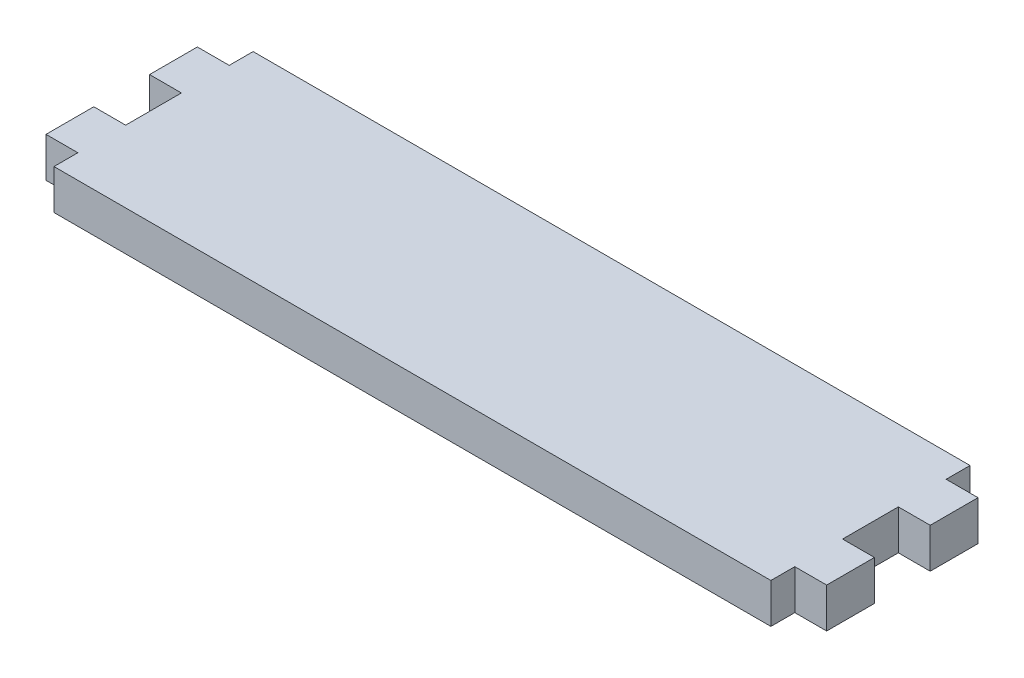
ISO-10303-21;
HEADER;
FILE_DESCRIPTION(('STEP AP214'),'2;1');
FILE_NAME('part.step','',(''),(''),'','','');
FILE_SCHEMA(('AUTOMOTIVE_DESIGN { 1 0 10303 214 1 1 1 1 }'));
ENDSEC;
DATA;
#1=APPLICATION_CONTEXT('core data for automotive mechanical design processes');
#2=APPLICATION_PROTOCOL_DEFINITION('international standard','automotive_design',2000,#1);
#3=PRODUCT_CONTEXT('',#1,'mechanical');
#4=PRODUCT('Part','Part','',(#3));
#5=PRODUCT_RELATED_PRODUCT_CATEGORY('part','',(#4));
#6=PRODUCT_DEFINITION_FORMATION('','',#4);
#7=PRODUCT_DEFINITION_CONTEXT('part definition',#1,'design');
#8=PRODUCT_DEFINITION('design','',#6,#7);
#9=PRODUCT_DEFINITION_SHAPE('','',#8);
#10=(LENGTH_UNIT() NAMED_UNIT(*) SI_UNIT(.MILLI.,.METRE.));
#11=(NAMED_UNIT(*) PLANE_ANGLE_UNIT() SI_UNIT($,.RADIAN.));
#12=(NAMED_UNIT(*) SI_UNIT($,.STERADIAN.) SOLID_ANGLE_UNIT());
#13=UNCERTAINTY_MEASURE_WITH_UNIT(LENGTH_MEASURE(1.E-05),#10,'distance_accuracy_value','');
#14=(GEOMETRIC_REPRESENTATION_CONTEXT(3) GLOBAL_UNCERTAINTY_ASSIGNED_CONTEXT((#13)) GLOBAL_UNIT_ASSIGNED_CONTEXT((#10,
#11,#12)) REPRESENTATION_CONTEXT('',''));
#15=CARTESIAN_POINT('',(0.,0.,0.));
#16=DIRECTION('',(0.,0.,1.));
#17=DIRECTION('',(1.,0.,0.));
#18=AXIS2_PLACEMENT_3D('',#15,#16,#17);
#19=CARTESIAN_POINT('',(90.,5.,0.));
#20=DIRECTION('',(0.,0.,-1.));
#21=DIRECTION('',(-1.,0.,0.));
#22=AXIS2_PLACEMENT_3D('',#19,#20,#21);
#23=PLANE('',#22);
#24=DIRECTION('',(1.,0.,0.));
#25=VECTOR('',#24,1.);
#26=CARTESIAN_POINT('',(90.,0.,0.));
#27=LINE('',#26,#25);
#28=CARTESIAN_POINT('',(0.,0.,0.));
#29=VERTEX_POINT('',#28);
#30=CARTESIAN_POINT('',(90.,0.,0.));
#31=VERTEX_POINT('',#30);
#32=EDGE_CURVE('E205',#29,#31,#27,.T.);
#33=ORIENTED_EDGE('',*,*,#32,.T.);
#34=DIRECTION('',(0.,-1.,0.));
#35=VECTOR('',#34,1.);
#36=CARTESIAN_POINT('',(90.,5.,0.));
#37=LINE('',#36,#35);
#38=CARTESIAN_POINT('',(90.,5.,0.));
#39=VERTEX_POINT('',#38);
#40=EDGE_CURVE('E11',#39,#31,#37,.T.);
#41=ORIENTED_EDGE('',*,*,#40,.F.);
#42=DIRECTION('',(1.,0.,0.));
#43=VECTOR('',#42,1.);
#44=CARTESIAN_POINT('',(90.,5.,0.));
#45=LINE('',#44,#43);
#46=CARTESIAN_POINT('',(0.,5.,0.));
#47=VERTEX_POINT('',#46);
#48=EDGE_CURVE('E243',#47,#39,#45,.T.);
#49=ORIENTED_EDGE('',*,*,#48,.F.);
#50=DIRECTION('',(0.,-1.,0.));
#51=VECTOR('',#50,1.);
#52=CARTESIAN_POINT('',(0.,5.,0.));
#53=LINE('',#52,#51);
#54=EDGE_CURVE('E201',#47,#29,#53,.T.);
#55=ORIENTED_EDGE('',*,*,#54,.T.);
#56=EDGE_LOOP('',(#33,#41,#49,#55));
#57=FACE_BOUND('',#56,.T.);
#58=ADVANCED_FACE('F37',(#57),#23,.F.);
#59=CARTESIAN_POINT('',(90.,5.,-3.));
#60=DIRECTION('',(-1.,0.,0.));
#61=DIRECTION('',(0.,0.,1.));
#62=AXIS2_PLACEMENT_3D('',#59,#60,#61);
#63=PLANE('',#62);
#64=DIRECTION('',(0.,0.,-1.));
#65=VECTOR('',#64,1.);
#66=CARTESIAN_POINT('',(90.,0.,-3.));
#67=LINE('',#66,#65);
#68=CARTESIAN_POINT('',(90.,0.,-3.));
#69=VERTEX_POINT('',#68);
#70=EDGE_CURVE('E208',#31,#69,#67,.T.);
#71=ORIENTED_EDGE('',*,*,#70,.T.);
#72=DIRECTION('',(0.,-1.,0.));
#73=VECTOR('',#72,1.);
#74=CARTESIAN_POINT('',(90.,5.,-3.));
#75=LINE('',#74,#73);
#76=CARTESIAN_POINT('',(90.,5.,-3.));
#77=VERTEX_POINT('',#76);
#78=EDGE_CURVE('E45',#77,#69,#75,.T.);
#79=ORIENTED_EDGE('',*,*,#78,.F.);
#80=DIRECTION('',(0.,0.,-1.));
#81=VECTOR('',#80,1.);
#82=CARTESIAN_POINT('',(90.,5.,-3.));
#83=LINE('',#82,#81);
#84=EDGE_CURVE('E132',#39,#77,#83,.T.);
#85=ORIENTED_EDGE('',*,*,#84,.F.);
#86=ORIENTED_EDGE('',*,*,#40,.T.);
#87=EDGE_LOOP('',(#71,#79,#85,#86));
#88=FACE_BOUND('',#87,.T.);
#89=ADVANCED_FACE('F361',(#88),#63,.F.);
#90=CARTESIAN_POINT('',(94.,5.,-3.));
#91=DIRECTION('',(0.,0.,-1.));
#92=DIRECTION('',(-1.,0.,0.));
#93=AXIS2_PLACEMENT_3D('',#90,#91,#92);
#94=PLANE('',#93);
#95=DIRECTION('',(1.,0.,0.));
#96=VECTOR('',#95,1.);
#97=CARTESIAN_POINT('',(94.,0.,-3.));
#98=LINE('',#97,#96);
#99=CARTESIAN_POINT('',(94.,0.,-3.));
#100=VERTEX_POINT('',#99);
#101=EDGE_CURVE('E210',#69,#100,#98,.T.);
#102=ORIENTED_EDGE('',*,*,#101,.T.);
#103=DIRECTION('',(0.,-1.,0.));
#104=VECTOR('',#103,1.);
#105=CARTESIAN_POINT('',(94.,5.,-3.));
#106=LINE('',#105,#104);
#107=CARTESIAN_POINT('',(94.,5.,-3.));
#108=VERTEX_POINT('',#107);
#109=EDGE_CURVE('E286',#108,#100,#106,.T.);
#110=ORIENTED_EDGE('',*,*,#109,.F.);
#111=DIRECTION('',(1.,0.,0.));
#112=VECTOR('',#111,1.);
#113=CARTESIAN_POINT('',(94.,5.,-3.));
#114=LINE('',#113,#112);
#115=EDGE_CURVE('E294',#77,#108,#114,.T.);
#116=ORIENTED_EDGE('',*,*,#115,.F.);
#117=ORIENTED_EDGE('',*,*,#78,.T.);
#118=EDGE_LOOP('',(#102,#110,#116,#117));
#119=FACE_BOUND('',#118,.T.);
#120=ADVANCED_FACE('F292',(#119),#94,.F.);
#121=CARTESIAN_POINT('',(94.,5.,-9.));
#122=DIRECTION('',(-1.,0.,0.));
#123=DIRECTION('',(0.,0.,1.));
#124=AXIS2_PLACEMENT_3D('',#121,#122,#123);
#125=PLANE('',#124);
#126=DIRECTION('',(0.,0.,-1.));
#127=VECTOR('',#126,1.);
#128=CARTESIAN_POINT('',(94.,0.,-9.));
#129=LINE('',#128,#127);
#130=CARTESIAN_POINT('',(94.,0.,-9.));
#131=VERTEX_POINT('',#130);
#132=EDGE_CURVE('E212',#100,#131,#129,.T.);
#133=ORIENTED_EDGE('',*,*,#132,.T.);
#134=DIRECTION('',(0.,-1.,0.));
#135=VECTOR('',#134,1.);
#136=CARTESIAN_POINT('',(94.,5.,-9.));
#137=LINE('',#136,#135);
#138=CARTESIAN_POINT('',(94.,5.,-9.));
#139=VERTEX_POINT('',#138);
#140=EDGE_CURVE('E283',#139,#131,#137,.T.);
#141=ORIENTED_EDGE('',*,*,#140,.F.);
#142=DIRECTION('',(0.,0.,-1.));
#143=VECTOR('',#142,1.);
#144=CARTESIAN_POINT('',(94.,5.,-9.));
#145=LINE('',#144,#143);
#146=EDGE_CURVE('E312',#108,#139,#145,.T.);
#147=ORIENTED_EDGE('',*,*,#146,.F.);
#148=ORIENTED_EDGE('',*,*,#109,.T.);
#149=EDGE_LOOP('',(#133,#141,#147,#148));
#150=FACE_BOUND('',#149,.T.);
#151=ADVANCED_FACE('F303',(#150),#125,.F.);
#152=CARTESIAN_POINT('',(90.,5.,-9.));
#153=DIRECTION('',(0.,0.,1.));
#154=DIRECTION('',(1.,0.,0.));
#155=AXIS2_PLACEMENT_3D('',#152,#153,#154);
#156=PLANE('',#155);
#157=DIRECTION('',(-1.,0.,0.));
#158=VECTOR('',#157,1.);
#159=CARTESIAN_POINT('',(90.,0.,-9.));
#160=LINE('',#159,#158);
#161=CARTESIAN_POINT('',(90.,0.,-9.));
#162=VERTEX_POINT('',#161);
#163=EDGE_CURVE('E214',#131,#162,#160,.T.);
#164=ORIENTED_EDGE('',*,*,#163,.T.);
#165=DIRECTION('',(0.,-1.,0.));
#166=VECTOR('',#165,1.);
#167=CARTESIAN_POINT('',(90.,5.,-9.));
#168=LINE('',#167,#166);
#169=CARTESIAN_POINT('',(90.,5.,-9.));
#170=VERTEX_POINT('',#169);
#171=EDGE_CURVE('E280',#170,#162,#168,.T.);
#172=ORIENTED_EDGE('',*,*,#171,.F.);
#173=DIRECTION('',(-1.,0.,0.));
#174=VECTOR('',#173,1.);
#175=CARTESIAN_POINT('',(90.,5.,-9.));
#176=LINE('',#175,#174);
#177=EDGE_CURVE('E309',#139,#170,#176,.T.);
#178=ORIENTED_EDGE('',*,*,#177,.F.);
#179=ORIENTED_EDGE('',*,*,#140,.T.);
#180=EDGE_LOOP('',(#164,#172,#178,#179));
#181=FACE_BOUND('',#180,.T.);
#182=ADVANCED_FACE('F307',(#181),#156,.F.);
#183=CARTESIAN_POINT('',(90.,5.,-16.));
#184=DIRECTION('',(-1.,0.,0.));
#185=DIRECTION('',(0.,0.,1.));
#186=AXIS2_PLACEMENT_3D('',#183,#184,#185);
#187=PLANE('',#186);
#188=DIRECTION('',(0.,0.,-1.));
#189=VECTOR('',#188,1.);
#190=CARTESIAN_POINT('',(90.,0.,-16.));
#191=LINE('',#190,#189);
#192=CARTESIAN_POINT('',(90.,0.,-16.));
#193=VERTEX_POINT('',#192);
#194=EDGE_CURVE('E216',#162,#193,#191,.T.);
#195=ORIENTED_EDGE('',*,*,#194,.T.);
#196=DIRECTION('',(0.,-1.,0.));
#197=VECTOR('',#196,1.);
#198=CARTESIAN_POINT('',(90.,5.,-16.));
#199=LINE('',#198,#197);
#200=CARTESIAN_POINT('',(90.,5.,-16.));
#201=VERTEX_POINT('',#200);
#202=EDGE_CURVE('E277',#201,#193,#199,.T.);
#203=ORIENTED_EDGE('',*,*,#202,.F.);
#204=DIRECTION('',(0.,0.,-1.));
#205=VECTOR('',#204,1.);
#206=CARTESIAN_POINT('',(90.,5.,-16.));
#207=LINE('',#206,#205);
#208=EDGE_CURVE('E311',#170,#201,#207,.T.);
#209=ORIENTED_EDGE('',*,*,#208,.F.);
#210=ORIENTED_EDGE('',*,*,#171,.T.);
#211=EDGE_LOOP('',(#195,#203,#209,#210));
#212=FACE_BOUND('',#211,.T.);
#213=ADVANCED_FACE('F374',(#212),#187,.F.);
#214=CARTESIAN_POINT('',(94.,5.,-16.));
#215=DIRECTION('',(0.,0.,-1.));
#216=DIRECTION('',(-1.,0.,0.));
#217=AXIS2_PLACEMENT_3D('',#214,#215,#216);
#218=PLANE('',#217);
#219=DIRECTION('',(1.,0.,0.));
#220=VECTOR('',#219,1.);
#221=CARTESIAN_POINT('',(94.,0.,-16.));
#222=LINE('',#221,#220);
#223=CARTESIAN_POINT('',(94.,0.,-16.));
#224=VERTEX_POINT('',#223);
#225=EDGE_CURVE('E218',#193,#224,#222,.T.);
#226=ORIENTED_EDGE('',*,*,#225,.T.);
#227=DIRECTION('',(0.,-1.,0.));
#228=VECTOR('',#227,1.);
#229=CARTESIAN_POINT('',(94.,5.,-16.));
#230=LINE('',#229,#228);
#231=CARTESIAN_POINT('',(94.,5.,-16.));
#232=VERTEX_POINT('',#231);
#233=EDGE_CURVE('E274',#232,#224,#230,.T.);
#234=ORIENTED_EDGE('',*,*,#233,.F.);
#235=DIRECTION('',(1.,0.,0.));
#236=VECTOR('',#235,1.);
#237=CARTESIAN_POINT('',(94.,5.,-16.));
#238=LINE('',#237,#236);
#239=EDGE_CURVE('E314',#201,#232,#238,.T.);
#240=ORIENTED_EDGE('',*,*,#239,.F.);
#241=ORIENTED_EDGE('',*,*,#202,.T.);
#242=EDGE_LOOP('',(#226,#234,#240,#241));
#243=FACE_BOUND('',#242,.T.);
#244=ADVANCED_FACE('F377',(#243),#218,.F.);
#245=CARTESIAN_POINT('',(94.,5.,-22.));
#246=DIRECTION('',(-1.,0.,0.));
#247=DIRECTION('',(0.,0.,1.));
#248=AXIS2_PLACEMENT_3D('',#245,#246,#247);
#249=PLANE('',#248);
#250=DIRECTION('',(0.,0.,-1.));
#251=VECTOR('',#250,1.);
#252=CARTESIAN_POINT('',(94.,0.,-22.));
#253=LINE('',#252,#251);
#254=CARTESIAN_POINT('',(94.,0.,-22.));
#255=VERTEX_POINT('',#254);
#256=EDGE_CURVE('E220',#224,#255,#253,.T.);
#257=ORIENTED_EDGE('',*,*,#256,.T.);
#258=DIRECTION('',(0.,-1.,0.));
#259=VECTOR('',#258,1.);
#260=CARTESIAN_POINT('',(94.,5.,-22.));
#261=LINE('',#260,#259);
#262=CARTESIAN_POINT('',(94.,5.,-22.));
#263=VERTEX_POINT('',#262);
#264=EDGE_CURVE('E271',#263,#255,#261,.T.);
#265=ORIENTED_EDGE('',*,*,#264,.F.);
#266=DIRECTION('',(0.,0.,-1.));
#267=VECTOR('',#266,1.);
#268=CARTESIAN_POINT('',(94.,5.,-22.));
#269=LINE('',#268,#267);
#270=EDGE_CURVE('E320',#232,#263,#269,.T.);
#271=ORIENTED_EDGE('',*,*,#270,.F.);
#272=ORIENTED_EDGE('',*,*,#233,.T.);
#273=EDGE_LOOP('',(#257,#265,#271,#272));
#274=FACE_BOUND('',#273,.T.);
#275=ADVANCED_FACE('F381',(#274),#249,.F.);
#276=CARTESIAN_POINT('',(90.,5.,-22.));
#277=DIRECTION('',(0.,0.,1.));
#278=DIRECTION('',(1.,0.,0.));
#279=AXIS2_PLACEMENT_3D('',#276,#277,#278);
#280=PLANE('',#279);
#281=DIRECTION('',(-1.,0.,0.));
#282=VECTOR('',#281,1.);
#283=CARTESIAN_POINT('',(90.,0.,-22.));
#284=LINE('',#283,#282);
#285=CARTESIAN_POINT('',(90.,0.,-22.));
#286=VERTEX_POINT('',#285);
#287=EDGE_CURVE('E222',#255,#286,#284,.T.);
#288=ORIENTED_EDGE('',*,*,#287,.T.);
#289=DIRECTION('',(0.,-1.,0.));
#290=VECTOR('',#289,1.);
#291=CARTESIAN_POINT('',(90.,5.,-22.));
#292=LINE('',#291,#290);
#293=CARTESIAN_POINT('',(90.,5.,-22.));
#294=VERTEX_POINT('',#293);
#295=EDGE_CURVE('E268',#294,#286,#292,.T.);
#296=ORIENTED_EDGE('',*,*,#295,.F.);
#297=DIRECTION('',(-1.,0.,0.));
#298=VECTOR('',#297,1.);
#299=CARTESIAN_POINT('',(90.,5.,-22.));
#300=LINE('',#299,#298);
#301=EDGE_CURVE('E322',#263,#294,#300,.T.);
#302=ORIENTED_EDGE('',*,*,#301,.F.);
#303=ORIENTED_EDGE('',*,*,#264,.T.);
#304=EDGE_LOOP('',(#288,#296,#302,#303));
#305=FACE_BOUND('',#304,.T.);
#306=ADVANCED_FACE('F385',(#305),#280,.F.);
#307=CARTESIAN_POINT('',(90.,5.,-25.));
#308=DIRECTION('',(-1.,0.,0.));
#309=DIRECTION('',(0.,0.,1.));
#310=AXIS2_PLACEMENT_3D('',#307,#308,#309);
#311=PLANE('',#310);
#312=DIRECTION('',(0.,0.,-1.));
#313=VECTOR('',#312,1.);
#314=CARTESIAN_POINT('',(90.,0.,-25.));
#315=LINE('',#314,#313);
#316=CARTESIAN_POINT('',(90.,0.,-25.));
#317=VERTEX_POINT('',#316);
#318=EDGE_CURVE('E224',#286,#317,#315,.T.);
#319=ORIENTED_EDGE('',*,*,#318,.T.);
#320=DIRECTION('',(0.,-1.,0.));
#321=VECTOR('',#320,1.);
#322=CARTESIAN_POINT('',(90.,5.,-25.));
#323=LINE('',#322,#321);
#324=CARTESIAN_POINT('',(90.,5.,-25.));
#325=VERTEX_POINT('',#324);
#326=EDGE_CURVE('E265',#325,#317,#323,.T.);
#327=ORIENTED_EDGE('',*,*,#326,.F.);
#328=DIRECTION('',(0.,0.,-1.));
#329=VECTOR('',#328,1.);
#330=CARTESIAN_POINT('',(90.,5.,-25.));
#331=LINE('',#330,#329);
#332=EDGE_CURVE('E324',#294,#325,#331,.T.);
#333=ORIENTED_EDGE('',*,*,#332,.F.);
#334=ORIENTED_EDGE('',*,*,#295,.T.);
#335=EDGE_LOOP('',(#319,#327,#333,#334));
#336=FACE_BOUND('',#335,.T.);
#337=ADVANCED_FACE('F389',(#336),#311,.F.);
#338=CARTESIAN_POINT('',(0.,5.,-25.));
#339=DIRECTION('',(0.,0.,1.));
#340=DIRECTION('',(1.,0.,0.));
#341=AXIS2_PLACEMENT_3D('',#338,#339,#340);
#342=PLANE('',#341);
#343=DIRECTION('',(-1.,0.,0.));
#344=VECTOR('',#343,1.);
#345=CARTESIAN_POINT('',(0.,0.,-25.));
#346=LINE('',#345,#344);
#347=CARTESIAN_POINT('',(0.,0.,-25.));
#348=VERTEX_POINT('',#347);
#349=EDGE_CURVE('E226',#317,#348,#346,.T.);
#350=ORIENTED_EDGE('',*,*,#349,.T.);
#351=DIRECTION('',(0.,-1.,0.));
#352=VECTOR('',#351,1.);
#353=CARTESIAN_POINT('',(0.,5.,-25.));
#354=LINE('',#353,#352);
#355=CARTESIAN_POINT('',(0.,5.,-25.));
#356=VERTEX_POINT('',#355);
#357=EDGE_CURVE('E262',#356,#348,#354,.T.);
#358=ORIENTED_EDGE('',*,*,#357,.F.);
#359=DIRECTION('',(-1.,0.,0.));
#360=VECTOR('',#359,1.);
#361=CARTESIAN_POINT('',(0.,5.,-25.));
#362=LINE('',#361,#360);
#363=EDGE_CURVE('E326',#325,#356,#362,.T.);
#364=ORIENTED_EDGE('',*,*,#363,.F.);
#365=ORIENTED_EDGE('',*,*,#326,.T.);
#366=EDGE_LOOP('',(#350,#358,#364,#365));
#367=FACE_BOUND('',#366,.T.);
#368=ADVANCED_FACE('F393',(#367),#342,.F.);
#369=CARTESIAN_POINT('',(0.,5.,-22.));
#370=DIRECTION('',(1.,0.,0.));
#371=DIRECTION('',(0.,0.,-1.));
#372=AXIS2_PLACEMENT_3D('',#369,#370,#371);
#373=PLANE('',#372);
#374=DIRECTION('',(0.,0.,1.));
#375=VECTOR('',#374,1.);
#376=CARTESIAN_POINT('',(0.,0.,-22.));
#377=LINE('',#376,#375);
#378=CARTESIAN_POINT('',(0.,0.,-22.));
#379=VERTEX_POINT('',#378);
#380=EDGE_CURVE('E228',#348,#379,#377,.T.);
#381=ORIENTED_EDGE('',*,*,#380,.T.);
#382=DIRECTION('',(0.,-1.,0.));
#383=VECTOR('',#382,1.);
#384=CARTESIAN_POINT('',(0.,5.,-22.));
#385=LINE('',#384,#383);
#386=CARTESIAN_POINT('',(0.,5.,-22.));
#387=VERTEX_POINT('',#386);
#388=EDGE_CURVE('E259',#387,#379,#385,.T.);
#389=ORIENTED_EDGE('',*,*,#388,.F.);
#390=DIRECTION('',(0.,0.,1.));
#391=VECTOR('',#390,1.);
#392=CARTESIAN_POINT('',(0.,5.,-22.));
#393=LINE('',#392,#391);
#394=EDGE_CURVE('E328',#356,#387,#393,.T.);
#395=ORIENTED_EDGE('',*,*,#394,.F.);
#396=ORIENTED_EDGE('',*,*,#357,.T.);
#397=EDGE_LOOP('',(#381,#389,#395,#396));
#398=FACE_BOUND('',#397,.T.);
#399=ADVANCED_FACE('F397',(#398),#373,.F.);
#400=CARTESIAN_POINT('',(-4.,5.,-22.));
#401=DIRECTION('',(0.,0.,1.));
#402=DIRECTION('',(1.,0.,0.));
#403=AXIS2_PLACEMENT_3D('',#400,#401,#402);
#404=PLANE('',#403);
#405=DIRECTION('',(-1.,0.,0.));
#406=VECTOR('',#405,1.);
#407=CARTESIAN_POINT('',(-4.,0.,-22.));
#408=LINE('',#407,#406);
#409=CARTESIAN_POINT('',(-4.,0.,-22.));
#410=VERTEX_POINT('',#409);
#411=EDGE_CURVE('E230',#379,#410,#408,.T.);
#412=ORIENTED_EDGE('',*,*,#411,.T.);
#413=DIRECTION('',(0.,-1.,0.));
#414=VECTOR('',#413,1.);
#415=CARTESIAN_POINT('',(-4.,5.,-22.));
#416=LINE('',#415,#414);
#417=CARTESIAN_POINT('',(-4.,5.,-22.));
#418=VERTEX_POINT('',#417);
#419=EDGE_CURVE('E256',#418,#410,#416,.T.);
#420=ORIENTED_EDGE('',*,*,#419,.F.);
#421=DIRECTION('',(-1.,0.,0.));
#422=VECTOR('',#421,1.);
#423=CARTESIAN_POINT('',(-4.,5.,-22.));
#424=LINE('',#423,#422);
#425=EDGE_CURVE('E330',#387,#418,#424,.T.);
#426=ORIENTED_EDGE('',*,*,#425,.F.);
#427=ORIENTED_EDGE('',*,*,#388,.T.);
#428=EDGE_LOOP('',(#412,#420,#426,#427));
#429=FACE_BOUND('',#428,.T.);
#430=ADVANCED_FACE('F401',(#429),#404,.F.);
#431=CARTESIAN_POINT('',(-4.,5.,-16.));
#432=DIRECTION('',(1.,0.,0.));
#433=DIRECTION('',(0.,0.,-1.));
#434=AXIS2_PLACEMENT_3D('',#431,#432,#433);
#435=PLANE('',#434);
#436=DIRECTION('',(0.,0.,1.));
#437=VECTOR('',#436,1.);
#438=CARTESIAN_POINT('',(-4.,0.,-16.));
#439=LINE('',#438,#437);
#440=CARTESIAN_POINT('',(-4.,0.,-16.));
#441=VERTEX_POINT('',#440);
#442=EDGE_CURVE('E232',#410,#441,#439,.T.);
#443=ORIENTED_EDGE('',*,*,#442,.T.);
#444=DIRECTION('',(0.,-1.,0.));
#445=VECTOR('',#444,1.);
#446=CARTESIAN_POINT('',(-4.,5.,-16.));
#447=LINE('',#446,#445);
#448=CARTESIAN_POINT('',(-4.,5.,-16.));
#449=VERTEX_POINT('',#448);
#450=EDGE_CURVE('E253',#449,#441,#447,.T.);
#451=ORIENTED_EDGE('',*,*,#450,.F.);
#452=DIRECTION('',(0.,0.,1.));
#453=VECTOR('',#452,1.);
#454=CARTESIAN_POINT('',(-4.,5.,-16.));
#455=LINE('',#454,#453);
#456=EDGE_CURVE('E332',#418,#449,#455,.T.);
#457=ORIENTED_EDGE('',*,*,#456,.F.);
#458=ORIENTED_EDGE('',*,*,#419,.T.);
#459=EDGE_LOOP('',(#443,#451,#457,#458));
#460=FACE_BOUND('',#459,.T.);
#461=ADVANCED_FACE('F405',(#460),#435,.F.);
#462=CARTESIAN_POINT('',(0.,5.,-16.));
#463=DIRECTION('',(0.,0.,-1.));
#464=DIRECTION('',(-1.,0.,0.));
#465=AXIS2_PLACEMENT_3D('',#462,#463,#464);
#466=PLANE('',#465);
#467=DIRECTION('',(1.,0.,0.));
#468=VECTOR('',#467,1.);
#469=CARTESIAN_POINT('',(0.,0.,-16.));
#470=LINE('',#469,#468);
#471=CARTESIAN_POINT('',(0.,0.,-16.));
#472=VERTEX_POINT('',#471);
#473=EDGE_CURVE('E234',#441,#472,#470,.T.);
#474=ORIENTED_EDGE('',*,*,#473,.T.);
#475=DIRECTION('',(0.,-1.,0.));
#476=VECTOR('',#475,1.);
#477=CARTESIAN_POINT('',(0.,5.,-16.));
#478=LINE('',#477,#476);
#479=CARTESIAN_POINT('',(0.,5.,-16.));
#480=VERTEX_POINT('',#479);
#481=EDGE_CURVE('E250',#480,#472,#478,.T.);
#482=ORIENTED_EDGE('',*,*,#481,.F.);
#483=DIRECTION('',(1.,0.,0.));
#484=VECTOR('',#483,1.);
#485=CARTESIAN_POINT('',(0.,5.,-16.));
#486=LINE('',#485,#484);
#487=EDGE_CURVE('E334',#449,#480,#486,.T.);
#488=ORIENTED_EDGE('',*,*,#487,.F.);
#489=ORIENTED_EDGE('',*,*,#450,.T.);
#490=EDGE_LOOP('',(#474,#482,#488,#489));
#491=FACE_BOUND('',#490,.T.);
#492=ADVANCED_FACE('F409',(#491),#466,.F.);
#493=CARTESIAN_POINT('',(0.,5.,-9.));
#494=DIRECTION('',(1.,0.,0.));
#495=DIRECTION('',(0.,0.,-1.));
#496=AXIS2_PLACEMENT_3D('',#493,#494,#495);
#497=PLANE('',#496);
#498=DIRECTION('',(0.,0.,1.));
#499=VECTOR('',#498,1.);
#500=CARTESIAN_POINT('',(0.,0.,-9.));
#501=LINE('',#500,#499);
#502=CARTESIAN_POINT('',(0.,0.,-9.));
#503=VERTEX_POINT('',#502);
#504=EDGE_CURVE('E236',#472,#503,#501,.T.);
#505=ORIENTED_EDGE('',*,*,#504,.T.);
#506=DIRECTION('',(0.,-1.,0.));
#507=VECTOR('',#506,1.);
#508=CARTESIAN_POINT('',(0.,5.,-9.));
#509=LINE('',#508,#507);
#510=CARTESIAN_POINT('',(0.,5.,-9.));
#511=VERTEX_POINT('',#510);
#512=EDGE_CURVE('E247',#511,#503,#509,.T.);
#513=ORIENTED_EDGE('',*,*,#512,.F.);
#514=DIRECTION('',(0.,0.,1.));
#515=VECTOR('',#514,1.);
#516=CARTESIAN_POINT('',(0.,5.,-9.));
#517=LINE('',#516,#515);
#518=EDGE_CURVE('E336',#480,#511,#517,.T.);
#519=ORIENTED_EDGE('',*,*,#518,.F.);
#520=ORIENTED_EDGE('',*,*,#481,.T.);
#521=EDGE_LOOP('',(#505,#513,#519,#520));
#522=FACE_BOUND('',#521,.T.);
#523=ADVANCED_FACE('F342',(#522),#497,.F.);
#524=CARTESIAN_POINT('',(-4.,5.,-9.));
#525=DIRECTION('',(0.,0.,1.));
#526=DIRECTION('',(1.,0.,0.));
#527=AXIS2_PLACEMENT_3D('',#524,#525,#526);
#528=PLANE('',#527);
#529=DIRECTION('',(-1.,0.,0.));
#530=VECTOR('',#529,1.);
#531=CARTESIAN_POINT('',(-4.,0.,-9.));
#532=LINE('',#531,#530);
#533=CARTESIAN_POINT('',(-4.,0.,-9.));
#534=VERTEX_POINT('',#533);
#535=EDGE_CURVE('E238',#503,#534,#532,.T.);
#536=ORIENTED_EDGE('',*,*,#535,.T.);
#537=DIRECTION('',(0.,-1.,0.));
#538=VECTOR('',#537,1.);
#539=CARTESIAN_POINT('',(-4.,5.,-9.));
#540=LINE('',#539,#538);
#541=CARTESIAN_POINT('',(-4.,5.,-9.));
#542=VERTEX_POINT('',#541);
#543=EDGE_CURVE('E196',#542,#534,#540,.T.);
#544=ORIENTED_EDGE('',*,*,#543,.F.);
#545=DIRECTION('',(-1.,0.,0.));
#546=VECTOR('',#545,1.);
#547=CARTESIAN_POINT('',(-4.,5.,-9.));
#548=LINE('',#547,#546);
#549=EDGE_CURVE('E187',#511,#542,#548,.T.);
#550=ORIENTED_EDGE('',*,*,#549,.F.);
#551=ORIENTED_EDGE('',*,*,#512,.T.);
#552=EDGE_LOOP('',(#536,#544,#550,#551));
#553=FACE_BOUND('',#552,.T.);
#554=ADVANCED_FACE('F346',(#553),#528,.F.);
#555=CARTESIAN_POINT('',(-4.,5.,-3.));
#556=DIRECTION('',(1.,0.,0.));
#557=DIRECTION('',(0.,0.,-1.));
#558=AXIS2_PLACEMENT_3D('',#555,#556,#557);
#559=PLANE('',#558);
#560=DIRECTION('',(0.,0.,1.));
#561=VECTOR('',#560,1.);
#562=CARTESIAN_POINT('',(-4.,0.,-3.));
#563=LINE('',#562,#561);
#564=CARTESIAN_POINT('',(-4.,0.,-3.));
#565=VERTEX_POINT('',#564);
#566=EDGE_CURVE('E195',#534,#565,#563,.T.);
#567=ORIENTED_EDGE('',*,*,#566,.T.);
#568=DIRECTION('',(0.,-1.,0.));
#569=VECTOR('',#568,1.);
#570=CARTESIAN_POINT('',(-4.,5.,-3.));
#571=LINE('',#570,#569);
#572=CARTESIAN_POINT('',(-4.,5.,-3.));
#573=VERTEX_POINT('',#572);
#574=EDGE_CURVE('E192',#573,#565,#571,.T.);
#575=ORIENTED_EDGE('',*,*,#574,.F.);
#576=DIRECTION('',(0.,0.,1.));
#577=VECTOR('',#576,1.);
#578=CARTESIAN_POINT('',(-4.,5.,-3.));
#579=LINE('',#578,#577);
#580=EDGE_CURVE('E181',#542,#573,#579,.T.);
#581=ORIENTED_EDGE('',*,*,#580,.F.);
#582=ORIENTED_EDGE('',*,*,#543,.T.);
#583=EDGE_LOOP('',(#567,#575,#581,#582));
#584=FACE_BOUND('',#583,.T.);
#585=ADVANCED_FACE('F193',(#584),#559,.F.);
#586=CARTESIAN_POINT('',(0.,5.,-3.));
#587=DIRECTION('',(0.,0.,-1.));
#588=DIRECTION('',(-1.,0.,0.));
#589=AXIS2_PLACEMENT_3D('',#586,#587,#588);
#590=PLANE('',#589);
#591=DIRECTION('',(1.,0.,0.));
#592=VECTOR('',#591,1.);
#593=CARTESIAN_POINT('',(0.,0.,-3.));
#594=LINE('',#593,#592);
#595=CARTESIAN_POINT('',(0.,0.,-3.));
#596=VERTEX_POINT('',#595);
#597=EDGE_CURVE('E118',#565,#596,#594,.T.);
#598=ORIENTED_EDGE('',*,*,#597,.T.);
#599=DIRECTION('',(0.,-1.,0.));
#600=VECTOR('',#599,1.);
#601=CARTESIAN_POINT('',(0.,5.,-3.));
#602=LINE('',#601,#600);
#603=CARTESIAN_POINT('',(0.,5.,-3.));
#604=VERTEX_POINT('',#603);
#605=EDGE_CURVE('E197',#604,#596,#602,.T.);
#606=ORIENTED_EDGE('',*,*,#605,.F.);
#607=DIRECTION('',(1.,0.,0.));
#608=VECTOR('',#607,1.);
#609=CARTESIAN_POINT('',(0.,5.,-3.));
#610=LINE('',#609,#608);
#611=EDGE_CURVE('E185',#573,#604,#610,.T.);
#612=ORIENTED_EDGE('',*,*,#611,.F.);
#613=ORIENTED_EDGE('',*,*,#574,.T.);
#614=EDGE_LOOP('',(#598,#606,#612,#613));
#615=FACE_BOUND('',#614,.T.);
#616=ADVANCED_FACE('F199',(#615),#590,.F.);
#617=CARTESIAN_POINT('',(0.,5.,0.));
#618=DIRECTION('',(1.,0.,0.));
#619=DIRECTION('',(0.,0.,-1.));
#620=AXIS2_PLACEMENT_3D('',#617,#618,#619);
#621=PLANE('',#620);
#622=DIRECTION('',(0.,0.,1.));
#623=VECTOR('',#622,1.);
#624=CARTESIAN_POINT('',(0.,0.,0.));
#625=LINE('',#624,#623);
#626=EDGE_CURVE('E124',#596,#29,#625,.T.);
#627=ORIENTED_EDGE('',*,*,#626,.T.);
#628=ORIENTED_EDGE('',*,*,#54,.F.);
#629=DIRECTION('',(0.,0.,1.));
#630=VECTOR('',#629,1.);
#631=CARTESIAN_POINT('',(0.,5.,0.));
#632=LINE('',#631,#630);
#633=EDGE_CURVE('E53',#604,#47,#632,.T.);
#634=ORIENTED_EDGE('',*,*,#633,.F.);
#635=ORIENTED_EDGE('',*,*,#605,.T.);
#636=EDGE_LOOP('',(#627,#628,#634,#635));
#637=FACE_BOUND('',#636,.T.);
#638=ADVANCED_FACE('F350',(#637),#621,.F.);
#639=CARTESIAN_POINT('',(0.,5.,0.));
#640=DIRECTION('',(0.,-1.,0.));
#641=DIRECTION('',(0.,0.,-1.));
#642=AXIS2_PLACEMENT_3D('',#639,#640,#641);
#643=PLANE('',#642);
#644=ORIENTED_EDGE('',*,*,#48,.T.);
#645=ORIENTED_EDGE('',*,*,#84,.T.);
#646=ORIENTED_EDGE('',*,*,#115,.T.);
#647=ORIENTED_EDGE('',*,*,#146,.T.);
#648=ORIENTED_EDGE('',*,*,#177,.T.);
#649=ORIENTED_EDGE('',*,*,#208,.T.);
#650=ORIENTED_EDGE('',*,*,#239,.T.);
#651=ORIENTED_EDGE('',*,*,#270,.T.);
#652=ORIENTED_EDGE('',*,*,#301,.T.);
#653=ORIENTED_EDGE('',*,*,#332,.T.);
#654=ORIENTED_EDGE('',*,*,#363,.T.);
#655=ORIENTED_EDGE('',*,*,#394,.T.);
#656=ORIENTED_EDGE('',*,*,#425,.T.);
#657=ORIENTED_EDGE('',*,*,#456,.T.);
#658=ORIENTED_EDGE('',*,*,#487,.T.);
#659=ORIENTED_EDGE('',*,*,#518,.T.);
#660=ORIENTED_EDGE('',*,*,#549,.T.);
#661=ORIENTED_EDGE('',*,*,#580,.T.);
#662=ORIENTED_EDGE('',*,*,#611,.T.);
#663=ORIENTED_EDGE('',*,*,#633,.T.);
#664=EDGE_LOOP('',(#644,#645,#646,#647,#648,#649,#650,#651,#652,#653,#654,#655,#656,#657,#658,
#659,#660,#661,#662,#663));
#665=FACE_BOUND('',#664,.T.);
#666=ADVANCED_FACE('F183',(#665),#643,.F.);
#667=CARTESIAN_POINT('',(0.,0.,0.));
#668=DIRECTION('',(0.,-1.,0.));
#669=DIRECTION('',(0.,0.,-1.));
#670=AXIS2_PLACEMENT_3D('',#667,#668,#669);
#671=PLANE('',#670);
#672=ORIENTED_EDGE('',*,*,#32,.F.);
#673=ORIENTED_EDGE('',*,*,#626,.F.);
#674=ORIENTED_EDGE('',*,*,#597,.F.);
#675=ORIENTED_EDGE('',*,*,#566,.F.);
#676=ORIENTED_EDGE('',*,*,#535,.F.);
#677=ORIENTED_EDGE('',*,*,#504,.F.);
#678=ORIENTED_EDGE('',*,*,#473,.F.);
#679=ORIENTED_EDGE('',*,*,#442,.F.);
#680=ORIENTED_EDGE('',*,*,#411,.F.);
#681=ORIENTED_EDGE('',*,*,#380,.F.);
#682=ORIENTED_EDGE('',*,*,#349,.F.);
#683=ORIENTED_EDGE('',*,*,#318,.F.);
#684=ORIENTED_EDGE('',*,*,#287,.F.);
#685=ORIENTED_EDGE('',*,*,#256,.F.);
#686=ORIENTED_EDGE('',*,*,#225,.F.);
#687=ORIENTED_EDGE('',*,*,#194,.F.);
#688=ORIENTED_EDGE('',*,*,#163,.F.);
#689=ORIENTED_EDGE('',*,*,#132,.F.);
#690=ORIENTED_EDGE('',*,*,#101,.F.);
#691=ORIENTED_EDGE('',*,*,#70,.F.);
#692=EDGE_LOOP('',(#672,#673,#674,#675,#676,#677,#678,#679,#680,#681,#682,#683,#684,#685,#686,
#687,#688,#689,#690,#691));
#693=FACE_BOUND('',#692,.T.);
#694=ADVANCED_FACE('F298',(#693),#671,.T.);
#695=CLOSED_SHELL('',(#58,#89,#120,#151,#182,#213,#244,#275,#306,#337,#368,#399,#430,#461,#492,
#523,#554,#585,#616,#638,#666,#694));
#696=MANIFOLD_SOLID_BREP('B2',#695);
#697=ADVANCED_BREP_SHAPE_REPRESENTATION('',(#18,#696),#14);
#698=SHAPE_DEFINITION_REPRESENTATION(#9,#697);
ENDSEC;
END-ISO-10303-21;
